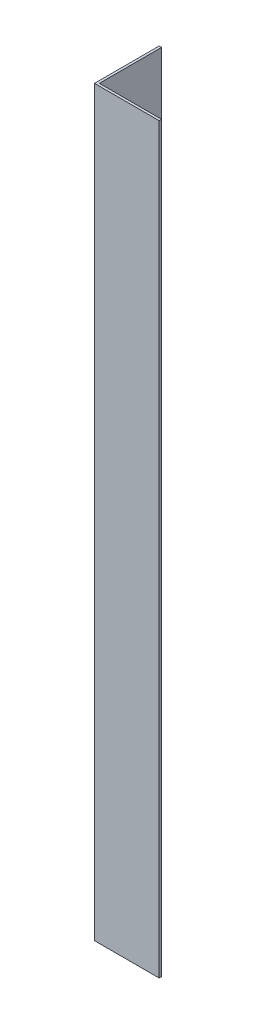
ISO-10303-21;
HEADER;
FILE_DESCRIPTION(('STEP AP214'),'2;1');
FILE_NAME('part.step','',(''),(''),'','','');
FILE_SCHEMA(('AUTOMOTIVE_DESIGN { 1 0 10303 214 1 1 1 1 }'));
ENDSEC;
DATA;
#1=APPLICATION_CONTEXT('core data for automotive mechanical design processes');
#2=APPLICATION_PROTOCOL_DEFINITION('international standard','automotive_design',2000,#1);
#3=PRODUCT_CONTEXT('',#1,'mechanical');
#4=PRODUCT('Part','Part','',(#3));
#5=PRODUCT_RELATED_PRODUCT_CATEGORY('part','',(#4));
#6=PRODUCT_DEFINITION_FORMATION('','',#4);
#7=PRODUCT_DEFINITION_CONTEXT('part definition',#1,'design');
#8=PRODUCT_DEFINITION('design','',#6,#7);
#9=PRODUCT_DEFINITION_SHAPE('','',#8);
#10=(LENGTH_UNIT() NAMED_UNIT(*) SI_UNIT(.MILLI.,.METRE.));
#11=(NAMED_UNIT(*) PLANE_ANGLE_UNIT() SI_UNIT($,.RADIAN.));
#12=(NAMED_UNIT(*) SI_UNIT($,.STERADIAN.) SOLID_ANGLE_UNIT());
#13=UNCERTAINTY_MEASURE_WITH_UNIT(LENGTH_MEASURE(1.E-05),#10,'distance_accuracy_value','');
#14=(GEOMETRIC_REPRESENTATION_CONTEXT(3) GLOBAL_UNCERTAINTY_ASSIGNED_CONTEXT((#13)) GLOBAL_UNIT_ASSIGNED_CONTEXT((#10,
#11,#12)) REPRESENTATION_CONTEXT('',''));
#15=CARTESIAN_POINT('',(0.,0.,0.));
#16=DIRECTION('',(0.,0.,1.));
#17=DIRECTION('',(1.,0.,0.));
#18=AXIS2_PLACEMENT_3D('',#15,#16,#17);
#19=CARTESIAN_POINT('',(20.,229.75,0.));
#20=DIRECTION('',(0.,0.,-1.));
#21=DIRECTION('',(-1.,0.,0.));
#22=AXIS2_PLACEMENT_3D('',#19,#20,#21);
#23=PLANE('',#22);
#24=DIRECTION('',(1.,0.,0.));
#25=VECTOR('',#24,1.);
#26=CARTESIAN_POINT('',(20.,0.,0.));
#27=LINE('',#26,#25);
#28=CARTESIAN_POINT('',(0.,0.,0.));
#29=VERTEX_POINT('',#28);
#30=CARTESIAN_POINT('',(20.,0.,0.));
#31=VERTEX_POINT('',#30);
#32=EDGE_CURVE('E119',#29,#31,#27,.T.);
#33=ORIENTED_EDGE('',*,*,#32,.T.);
#34=DIRECTION('',(0.,-1.,0.));
#35=VECTOR('',#34,1.);
#36=CARTESIAN_POINT('',(20.,229.75,0.));
#37=LINE('',#36,#35);
#38=CARTESIAN_POINT('',(20.,229.75,0.));
#39=VERTEX_POINT('',#38);
#40=EDGE_CURVE('E11',#39,#31,#37,.T.);
#41=ORIENTED_EDGE('',*,*,#40,.F.);
#42=DIRECTION('',(1.,0.,0.));
#43=VECTOR('',#42,1.);
#44=CARTESIAN_POINT('',(20.,229.75,0.));
#45=LINE('',#44,#43);
#46=CARTESIAN_POINT('',(0.,229.75,0.));
#47=VERTEX_POINT('',#46);
#48=EDGE_CURVE('E129',#47,#39,#45,.T.);
#49=ORIENTED_EDGE('',*,*,#48,.F.);
#50=DIRECTION('',(0.,-1.,0.));
#51=VECTOR('',#50,1.);
#52=CARTESIAN_POINT('',(0.,229.75,0.));
#53=LINE('',#52,#51);
#54=EDGE_CURVE('E115',#47,#29,#53,.T.);
#55=ORIENTED_EDGE('',*,*,#54,.T.);
#56=EDGE_LOOP('',(#33,#41,#49,#55));
#57=FACE_BOUND('',#56,.T.);
#58=ADVANCED_FACE('F35',(#57),#23,.F.);
#59=CARTESIAN_POINT('',(20.,229.75,-0.75));
#60=DIRECTION('',(-1.,0.,0.));
#61=DIRECTION('',(0.,0.,1.));
#62=AXIS2_PLACEMENT_3D('',#59,#60,#61);
#63=PLANE('',#62);
#64=DIRECTION('',(0.,0.,-1.));
#65=VECTOR('',#64,1.);
#66=CARTESIAN_POINT('',(20.,0.,-0.75));
#67=LINE('',#66,#65);
#68=CARTESIAN_POINT('',(20.,0.,-0.75));
#69=VERTEX_POINT('',#68);
#70=EDGE_CURVE('E122',#31,#69,#67,.T.);
#71=ORIENTED_EDGE('',*,*,#70,.T.);
#72=DIRECTION('',(0.,-1.,0.));
#73=VECTOR('',#72,1.);
#74=CARTESIAN_POINT('',(20.,229.75,-0.75));
#75=LINE('',#74,#73);
#76=CARTESIAN_POINT('',(20.,229.75,-0.75));
#77=VERTEX_POINT('',#76);
#78=EDGE_CURVE('E43',#77,#69,#75,.T.);
#79=ORIENTED_EDGE('',*,*,#78,.F.);
#80=DIRECTION('',(0.,0.,-1.));
#81=VECTOR('',#80,1.);
#82=CARTESIAN_POINT('',(20.,229.75,-0.75));
#83=LINE('',#82,#81);
#84=EDGE_CURVE('E88',#39,#77,#83,.T.);
#85=ORIENTED_EDGE('',*,*,#84,.F.);
#86=ORIENTED_EDGE('',*,*,#40,.T.);
#87=EDGE_LOOP('',(#71,#79,#85,#86));
#88=FACE_BOUND('',#87,.T.);
#89=ADVANCED_FACE('F153',(#88),#63,.F.);
#90=CARTESIAN_POINT('',(0.749999999999998,229.75,-0.749999999999998));
#91=DIRECTION('',(0.,0.,1.));
#92=DIRECTION('',(1.,0.,0.));
#93=AXIS2_PLACEMENT_3D('',#90,#91,#92);
#94=PLANE('',#93);
#95=DIRECTION('',(-1.,0.,0.));
#96=VECTOR('',#95,1.);
#97=CARTESIAN_POINT('',(0.749999999999998,0.,-0.749999999999998));
#98=LINE('',#97,#96);
#99=CARTESIAN_POINT('',(0.749999999999998,0.,-0.749999999999998));
#100=VERTEX_POINT('',#99);
#101=EDGE_CURVE('E124',#69,#100,#98,.T.);
#102=ORIENTED_EDGE('',*,*,#101,.T.);
#103=DIRECTION('',(0.,-1.,0.));
#104=VECTOR('',#103,1.);
#105=CARTESIAN_POINT('',(0.749999999999998,229.75,-0.749999999999998));
#106=LINE('',#105,#104);
#107=CARTESIAN_POINT('',(0.749999999999998,229.75,-0.749999999999998));
#108=VERTEX_POINT('',#107);
#109=EDGE_CURVE('E110',#108,#100,#106,.T.);
#110=ORIENTED_EDGE('',*,*,#109,.F.);
#111=DIRECTION('',(-1.,0.,0.));
#112=VECTOR('',#111,1.);
#113=CARTESIAN_POINT('',(0.749999999999998,229.75,-0.749999999999998));
#114=LINE('',#113,#112);
#115=EDGE_CURVE('E101',#77,#108,#114,.T.);
#116=ORIENTED_EDGE('',*,*,#115,.F.);
#117=ORIENTED_EDGE('',*,*,#78,.T.);
#118=EDGE_LOOP('',(#102,#110,#116,#117));
#119=FACE_BOUND('',#118,.T.);
#120=ADVANCED_FACE('F135',(#119),#94,.F.);
#121=CARTESIAN_POINT('',(0.749999999999998,229.75,-20.));
#122=DIRECTION('',(-1.,0.,0.));
#123=DIRECTION('',(0.,0.,1.));
#124=AXIS2_PLACEMENT_3D('',#121,#122,#123);
#125=PLANE('',#124);
#126=DIRECTION('',(0.,0.,-1.));
#127=VECTOR('',#126,1.);
#128=CARTESIAN_POINT('',(0.749999999999998,0.,-20.));
#129=LINE('',#128,#127);
#130=CARTESIAN_POINT('',(0.749999999999998,0.,-20.));
#131=VERTEX_POINT('',#130);
#132=EDGE_CURVE('E109',#100,#131,#129,.T.);
#133=ORIENTED_EDGE('',*,*,#132,.T.);
#134=DIRECTION('',(0.,-1.,0.));
#135=VECTOR('',#134,1.);
#136=CARTESIAN_POINT('',(0.749999999999998,229.75,-20.));
#137=LINE('',#136,#135);
#138=CARTESIAN_POINT('',(0.749999999999998,229.75,-20.));
#139=VERTEX_POINT('',#138);
#140=EDGE_CURVE('E106',#139,#131,#137,.T.);
#141=ORIENTED_EDGE('',*,*,#140,.F.);
#142=DIRECTION('',(0.,0.,-1.));
#143=VECTOR('',#142,1.);
#144=CARTESIAN_POINT('',(0.749999999999998,229.75,-20.));
#145=LINE('',#144,#143);
#146=EDGE_CURVE('E95',#108,#139,#145,.T.);
#147=ORIENTED_EDGE('',*,*,#146,.F.);
#148=ORIENTED_EDGE('',*,*,#109,.T.);
#149=EDGE_LOOP('',(#133,#141,#147,#148));
#150=FACE_BOUND('',#149,.T.);
#151=ADVANCED_FACE('F107',(#150),#125,.F.);
#152=CARTESIAN_POINT('',(0.,229.75,-20.));
#153=DIRECTION('',(0.,0.,1.));
#154=DIRECTION('',(1.,0.,0.));
#155=AXIS2_PLACEMENT_3D('',#152,#153,#154);
#156=PLANE('',#155);
#157=DIRECTION('',(-1.,0.,0.));
#158=VECTOR('',#157,1.);
#159=CARTESIAN_POINT('',(0.,0.,-20.));
#160=LINE('',#159,#158);
#161=CARTESIAN_POINT('',(0.,0.,-20.));
#162=VERTEX_POINT('',#161);
#163=EDGE_CURVE('E74',#131,#162,#160,.T.);
#164=ORIENTED_EDGE('',*,*,#163,.T.);
#165=DIRECTION('',(0.,-1.,0.));
#166=VECTOR('',#165,1.);
#167=CARTESIAN_POINT('',(0.,229.75,-20.));
#168=LINE('',#167,#166);
#169=CARTESIAN_POINT('',(0.,229.75,-20.));
#170=VERTEX_POINT('',#169);
#171=EDGE_CURVE('E111',#170,#162,#168,.T.);
#172=ORIENTED_EDGE('',*,*,#171,.F.);
#173=DIRECTION('',(-1.,0.,0.));
#174=VECTOR('',#173,1.);
#175=CARTESIAN_POINT('',(0.,229.75,-20.));
#176=LINE('',#175,#174);
#177=EDGE_CURVE('E99',#139,#170,#176,.T.);
#178=ORIENTED_EDGE('',*,*,#177,.F.);
#179=ORIENTED_EDGE('',*,*,#140,.T.);
#180=EDGE_LOOP('',(#164,#172,#178,#179));
#181=FACE_BOUND('',#180,.T.);
#182=ADVANCED_FACE('F113',(#181),#156,.F.);
#183=CARTESIAN_POINT('',(0.,229.75,0.));
#184=DIRECTION('',(1.,0.,0.));
#185=DIRECTION('',(0.,0.,-1.));
#186=AXIS2_PLACEMENT_3D('',#183,#184,#185);
#187=PLANE('',#186);
#188=DIRECTION('',(0.,0.,1.));
#189=VECTOR('',#188,1.);
#190=CARTESIAN_POINT('',(0.,0.,0.));
#191=LINE('',#190,#189);
#192=EDGE_CURVE('E80',#162,#29,#191,.T.);
#193=ORIENTED_EDGE('',*,*,#192,.T.);
#194=ORIENTED_EDGE('',*,*,#54,.F.);
#195=DIRECTION('',(0.,0.,1.));
#196=VECTOR('',#195,1.);
#197=CARTESIAN_POINT('',(0.,229.75,0.));
#198=LINE('',#197,#196);
#199=EDGE_CURVE('E51',#170,#47,#198,.T.);
#200=ORIENTED_EDGE('',*,*,#199,.F.);
#201=ORIENTED_EDGE('',*,*,#171,.T.);
#202=EDGE_LOOP('',(#193,#194,#200,#201));
#203=FACE_BOUND('',#202,.T.);
#204=ADVANCED_FACE('F142',(#203),#187,.F.);
#205=CARTESIAN_POINT('',(0.,229.75,0.));
#206=DIRECTION('',(0.,-1.,0.));
#207=DIRECTION('',(0.,0.,-1.));
#208=AXIS2_PLACEMENT_3D('',#205,#206,#207);
#209=PLANE('',#208);
#210=ORIENTED_EDGE('',*,*,#48,.T.);
#211=ORIENTED_EDGE('',*,*,#84,.T.);
#212=ORIENTED_EDGE('',*,*,#115,.T.);
#213=ORIENTED_EDGE('',*,*,#146,.T.);
#214=ORIENTED_EDGE('',*,*,#177,.T.);
#215=ORIENTED_EDGE('',*,*,#199,.T.);
#216=EDGE_LOOP('',(#210,#211,#212,#213,#214,#215));
#217=FACE_BOUND('',#216,.T.);
#218=ADVANCED_FACE('F97',(#217),#209,.F.);
#219=CARTESIAN_POINT('',(0.,0.,0.));
#220=DIRECTION('',(0.,-1.,0.));
#221=DIRECTION('',(0.,0.,-1.));
#222=AXIS2_PLACEMENT_3D('',#219,#220,#221);
#223=PLANE('',#222);
#224=ORIENTED_EDGE('',*,*,#32,.F.);
#225=ORIENTED_EDGE('',*,*,#192,.F.);
#226=ORIENTED_EDGE('',*,*,#163,.F.);
#227=ORIENTED_EDGE('',*,*,#132,.F.);
#228=ORIENTED_EDGE('',*,*,#101,.F.);
#229=ORIENTED_EDGE('',*,*,#70,.F.);
#230=EDGE_LOOP('',(#224,#225,#226,#227,#228,#229));
#231=FACE_BOUND('',#230,.T.);
#232=ADVANCED_FACE('F138',(#231),#223,.T.);
#233=CLOSED_SHELL('',(#58,#89,#120,#151,#182,#204,#218,#232));
#234=MANIFOLD_SOLID_BREP('B2',#233);
#235=ADVANCED_BREP_SHAPE_REPRESENTATION('',(#18,#234),#14);
#236=SHAPE_DEFINITION_REPRESENTATION(#9,#235);
ENDSEC;
END-ISO-10303-21;
